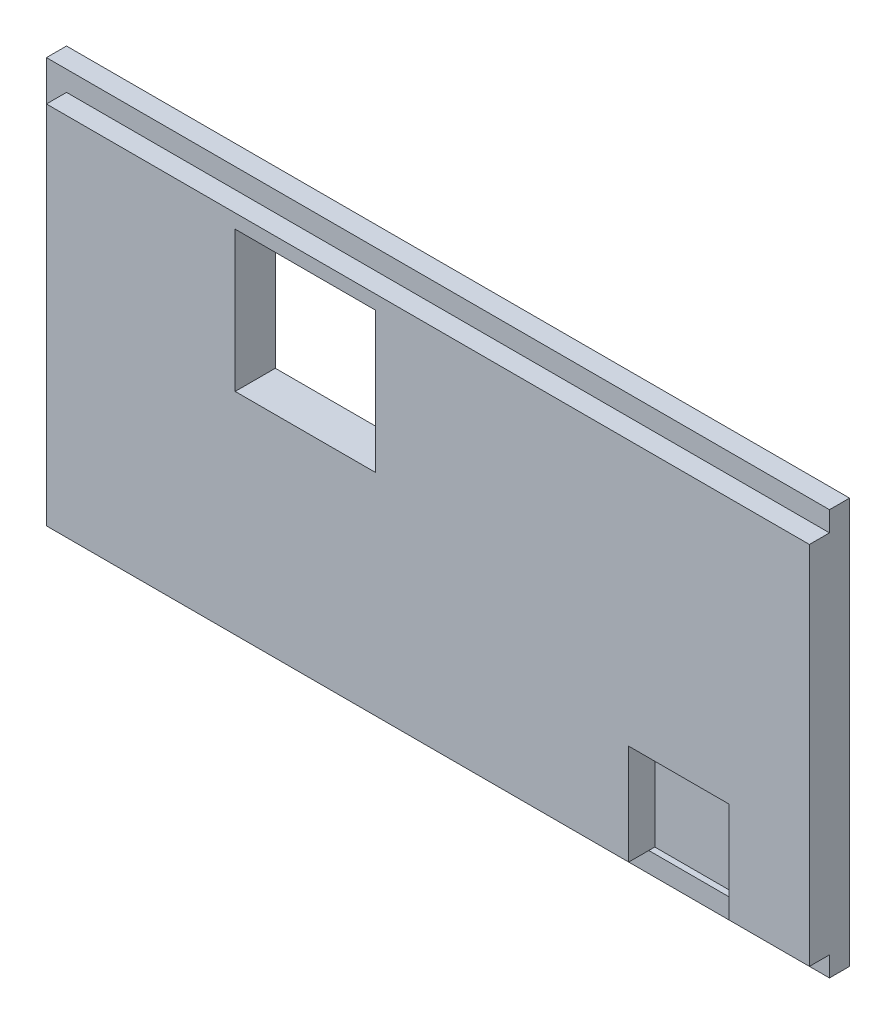
ISO-10303-21;
HEADER;
FILE_DESCRIPTION(('STEP AP214'),'2;1');
FILE_NAME('part.step','',(''),(''),'','','');
FILE_SCHEMA(('AUTOMOTIVE_DESIGN { 1 0 10303 214 1 1 1 1 }'));
ENDSEC;
DATA;
#1=APPLICATION_CONTEXT('core data for automotive mechanical design processes');
#2=APPLICATION_PROTOCOL_DEFINITION('international standard','automotive_design',2000,#1);
#3=PRODUCT_CONTEXT('',#1,'mechanical');
#4=PRODUCT('Part','Part','',(#3));
#5=PRODUCT_RELATED_PRODUCT_CATEGORY('part','',(#4));
#6=PRODUCT_DEFINITION_FORMATION('','',#4);
#7=PRODUCT_DEFINITION_CONTEXT('part definition',#1,'design');
#8=PRODUCT_DEFINITION('design','',#6,#7);
#9=PRODUCT_DEFINITION_SHAPE('','',#8);
#10=(LENGTH_UNIT() NAMED_UNIT(*) SI_UNIT(.MILLI.,.METRE.));
#11=(NAMED_UNIT(*) PLANE_ANGLE_UNIT() SI_UNIT($,.RADIAN.));
#12=(NAMED_UNIT(*) SI_UNIT($,.STERADIAN.) SOLID_ANGLE_UNIT());
#13=UNCERTAINTY_MEASURE_WITH_UNIT(LENGTH_MEASURE(1.E-05),#10,'distance_accuracy_value','');
#14=(GEOMETRIC_REPRESENTATION_CONTEXT(3) GLOBAL_UNCERTAINTY_ASSIGNED_CONTEXT((#13)) GLOBAL_UNIT_ASSIGNED_CONTEXT((#10,
#11,#12)) REPRESENTATION_CONTEXT('',''));
#15=CARTESIAN_POINT('',(0.,0.,0.));
#16=DIRECTION('',(0.,0.,1.));
#17=DIRECTION('',(1.,0.,0.));
#18=AXIS2_PLACEMENT_3D('',#15,#16,#17);
#19=CARTESIAN_POINT('',(-18.5,-9.1,2.));
#20=DIRECTION('',(0.,1.,0.));
#21=DIRECTION('',(-1.,0.,0.));
#22=AXIS2_PLACEMENT_3D('',#19,#20,#21);
#23=PLANE('',#22);
#24=DIRECTION('',(1.,0.,0.));
#25=VECTOR('',#24,1.);
#26=CARTESIAN_POINT('',(-18.5,-9.1,1.));
#27=LINE('',#26,#25);
#28=CARTESIAN_POINT('',(-18.5,-9.1,1.));
#29=VERTEX_POINT('',#28);
#30=CARTESIAN_POINT('',(10.5,-9.1,1.));
#31=VERTEX_POINT('',#30);
#32=EDGE_CURVE('E242',#29,#31,#27,.T.);
#33=ORIENTED_EDGE('',*,*,#32,.T.);
#34=DIRECTION('',(0.,0.,1.));
#35=VECTOR('',#34,1.);
#36=CARTESIAN_POINT('',(10.5,-9.1,0.7));
#37=LINE('',#36,#35);
#38=CARTESIAN_POINT('',(10.5,-9.1,2.));
#39=VERTEX_POINT('',#38);
#40=EDGE_CURVE('E161',#31,#39,#37,.T.);
#41=ORIENTED_EDGE('',*,*,#40,.T.);
#42=DIRECTION('',(1.,0.,0.));
#43=VECTOR('',#42,1.);
#44=CARTESIAN_POINT('',(-18.5,-9.1,2.));
#45=LINE('',#44,#43);
#46=CARTESIAN_POINT('',(-18.5,-9.1,2.));
#47=VERTEX_POINT('',#46);
#48=EDGE_CURVE('E231',#47,#39,#45,.T.);
#49=ORIENTED_EDGE('',*,*,#48,.F.);
#50=DIRECTION('',(0.,0.,-1.));
#51=VECTOR('',#50,1.);
#52=CARTESIAN_POINT('',(-18.5,-9.1,2.));
#53=LINE('',#52,#51);
#54=EDGE_CURVE('E255',#47,#29,#53,.T.);
#55=ORIENTED_EDGE('',*,*,#54,.T.);
#56=EDGE_LOOP('',(#33,#41,#49,#55));
#57=FACE_BOUND('',#56,.T.);
#58=ADVANCED_FACE('F33',(#57),#23,.F.);
#59=CARTESIAN_POINT('',(19.5,10.1,1.));
#60=DIRECTION('',(-1.,0.,0.));
#61=DIRECTION('',(0.,0.,1.));
#62=AXIS2_PLACEMENT_3D('',#59,#60,#61);
#63=PLANE('',#62);
#64=DIRECTION('',(0.,1.,0.));
#65=VECTOR('',#64,1.);
#66=CARTESIAN_POINT('',(19.5,10.1,0.));
#67=LINE('',#66,#65);
#68=CARTESIAN_POINT('',(19.5,-10.1,0.));
#69=VERTEX_POINT('',#68);
#70=CARTESIAN_POINT('',(19.5,10.1,0.));
#71=VERTEX_POINT('',#70);
#72=EDGE_CURVE('E258',#69,#71,#67,.T.);
#73=ORIENTED_EDGE('',*,*,#72,.T.);
#74=DIRECTION('',(0.,0.,-1.));
#75=VECTOR('',#74,1.);
#76=CARTESIAN_POINT('',(19.5,10.1,1.));
#77=LINE('',#76,#75);
#78=CARTESIAN_POINT('',(19.5,10.1,1.));
#79=VERTEX_POINT('',#78);
#80=EDGE_CURVE('E11',#79,#71,#77,.T.);
#81=ORIENTED_EDGE('',*,*,#80,.F.);
#82=DIRECTION('',(0.,1.,0.));
#83=VECTOR('',#82,1.);
#84=CARTESIAN_POINT('',(19.5,10.1,1.));
#85=LINE('',#84,#83);
#86=CARTESIAN_POINT('',(19.5,9.1,1.));
#87=VERTEX_POINT('',#86);
#88=EDGE_CURVE('E263',#87,#79,#85,.T.);
#89=ORIENTED_EDGE('',*,*,#88,.F.);
#90=DIRECTION('',(0.,0.,-1.));
#91=VECTOR('',#90,1.);
#92=CARTESIAN_POINT('',(19.5,9.1,2.));
#93=LINE('',#92,#91);
#94=CARTESIAN_POINT('',(19.5,9.1,2.));
#95=VERTEX_POINT('',#94);
#96=EDGE_CURVE('E249',#95,#87,#93,.T.);
#97=ORIENTED_EDGE('',*,*,#96,.F.);
#98=DIRECTION('',(0.,1.,0.));
#99=VECTOR('',#98,1.);
#100=CARTESIAN_POINT('',(19.5,9.1,2.));
#101=LINE('',#100,#99);
#102=CARTESIAN_POINT('',(19.5,-9.1,2.));
#103=VERTEX_POINT('',#102);
#104=EDGE_CURVE('E234',#103,#95,#101,.T.);
#105=ORIENTED_EDGE('',*,*,#104,.F.);
#106=DIRECTION('',(0.,0.,-1.));
#107=VECTOR('',#106,1.);
#108=CARTESIAN_POINT('',(19.5,-9.1,2.));
#109=LINE('',#108,#107);
#110=CARTESIAN_POINT('',(19.5,-9.1,1.));
#111=VERTEX_POINT('',#110);
#112=EDGE_CURVE('E252',#103,#111,#109,.T.);
#113=ORIENTED_EDGE('',*,*,#112,.T.);
#114=CARTESIAN_POINT('',(19.5,-10.1,1.));
#115=VERTEX_POINT('',#114);
#116=EDGE_CURVE('E259',#115,#111,#85,.T.);
#117=ORIENTED_EDGE('',*,*,#116,.F.);
#118=DIRECTION('',(0.,0.,-1.));
#119=VECTOR('',#118,1.);
#120=CARTESIAN_POINT('',(19.5,-10.1,1.));
#121=LINE('',#120,#119);
#122=EDGE_CURVE('E269',#115,#69,#121,.T.);
#123=ORIENTED_EDGE('',*,*,#122,.T.);
#124=EDGE_LOOP('',(#73,#81,#89,#97,#105,#113,#117,#123));
#125=FACE_BOUND('',#124,.T.);
#126=ADVANCED_FACE('F35',(#125),#63,.F.);
#127=CARTESIAN_POINT('',(-19.5,10.1,1.));
#128=DIRECTION('',(0.,-1.,0.));
#129=DIRECTION('',(0.,0.,-1.));
#130=AXIS2_PLACEMENT_3D('',#127,#128,#129);
#131=PLANE('',#130);
#132=DIRECTION('',(-1.,0.,0.));
#133=VECTOR('',#132,1.);
#134=CARTESIAN_POINT('',(-19.5,10.1,0.));
#135=LINE('',#134,#133);
#136=CARTESIAN_POINT('',(-19.5,10.1,0.));
#137=VERTEX_POINT('',#136);
#138=EDGE_CURVE('E272',#71,#137,#135,.T.);
#139=ORIENTED_EDGE('',*,*,#138,.T.);
#140=DIRECTION('',(0.,0.,-1.));
#141=VECTOR('',#140,1.);
#142=CARTESIAN_POINT('',(-19.5,10.1,1.));
#143=LINE('',#142,#141);
#144=CARTESIAN_POINT('',(-19.5,10.1,1.));
#145=VERTEX_POINT('',#144);
#146=EDGE_CURVE('E41',#145,#137,#143,.T.);
#147=ORIENTED_EDGE('',*,*,#146,.F.);
#148=DIRECTION('',(-1.,0.,0.));
#149=VECTOR('',#148,1.);
#150=CARTESIAN_POINT('',(-19.5,10.1,1.));
#151=LINE('',#150,#149);
#152=EDGE_CURVE('E262',#79,#145,#151,.T.);
#153=ORIENTED_EDGE('',*,*,#152,.F.);
#154=ORIENTED_EDGE('',*,*,#80,.T.);
#155=EDGE_LOOP('',(#139,#147,#153,#154));
#156=FACE_BOUND('',#155,.T.);
#157=ADVANCED_FACE('F308',(#156),#131,.F.);
#158=CARTESIAN_POINT('',(-19.5,10.1,1.));
#159=DIRECTION('',(1.,0.,0.));
#160=DIRECTION('',(0.,0.,-1.));
#161=AXIS2_PLACEMENT_3D('',#158,#159,#160);
#162=PLANE('',#161);
#163=DIRECTION('',(0.,-1.,0.));
#164=VECTOR('',#163,1.);
#165=CARTESIAN_POINT('',(-19.5,10.1,0.));
#166=LINE('',#165,#164);
#167=CARTESIAN_POINT('',(-19.5,-10.1,0.));
#168=VERTEX_POINT('',#167);
#169=EDGE_CURVE('E274',#137,#168,#166,.T.);
#170=ORIENTED_EDGE('',*,*,#169,.T.);
#171=DIRECTION('',(0.,0.,-1.));
#172=VECTOR('',#171,1.);
#173=CARTESIAN_POINT('',(-19.5,-10.1,1.));
#174=LINE('',#173,#172);
#175=CARTESIAN_POINT('',(-19.5,-10.1,1.));
#176=VERTEX_POINT('',#175);
#177=EDGE_CURVE('E280',#176,#168,#174,.T.);
#178=ORIENTED_EDGE('',*,*,#177,.F.);
#179=DIRECTION('',(0.,-1.,0.));
#180=VECTOR('',#179,1.);
#181=CARTESIAN_POINT('',(-19.5,10.1,1.));
#182=LINE('',#181,#180);
#183=EDGE_CURVE('E265',#145,#176,#182,.T.);
#184=ORIENTED_EDGE('',*,*,#183,.F.);
#185=ORIENTED_EDGE('',*,*,#146,.T.);
#186=EDGE_LOOP('',(#170,#178,#184,#185));
#187=FACE_BOUND('',#186,.T.);
#188=ADVANCED_FACE('F287',(#187),#162,.F.);
#189=CARTESIAN_POINT('',(-19.5,-10.1,1.));
#190=DIRECTION('',(0.,1.,0.));
#191=DIRECTION('',(0.,0.,1.));
#192=AXIS2_PLACEMENT_3D('',#189,#190,#191);
#193=PLANE('',#192);
#194=DIRECTION('',(1.,0.,0.));
#195=VECTOR('',#194,1.);
#196=CARTESIAN_POINT('',(-19.5,-10.1,0.));
#197=LINE('',#196,#195);
#198=EDGE_CURVE('E276',#168,#69,#197,.T.);
#199=ORIENTED_EDGE('',*,*,#198,.T.);
#200=ORIENTED_EDGE('',*,*,#122,.F.);
#201=DIRECTION('',(1.,0.,0.));
#202=VECTOR('',#201,1.);
#203=CARTESIAN_POINT('',(-19.5,-10.1,1.));
#204=LINE('',#203,#202);
#205=EDGE_CURVE('E267',#176,#115,#204,.T.);
#206=ORIENTED_EDGE('',*,*,#205,.F.);
#207=ORIENTED_EDGE('',*,*,#177,.T.);
#208=EDGE_LOOP('',(#199,#200,#206,#207));
#209=FACE_BOUND('',#208,.T.);
#210=ADVANCED_FACE('F297',(#209),#193,.F.);
#211=CARTESIAN_POINT('',(0.,0.,1.));
#212=DIRECTION('',(0.,0.,1.));
#213=DIRECTION('',(1.,0.,0.));
#214=AXIS2_PLACEMENT_3D('',#211,#212,#213);
#215=PLANE('',#214);
#216=DIRECTION('',(-1.,0.,0.));
#217=VECTOR('',#216,1.);
#218=CARTESIAN_POINT('',(-18.5,9.1,1.));
#219=LINE('',#218,#217);
#220=CARTESIAN_POINT('',(-18.5,9.1,1.));
#221=VERTEX_POINT('',#220);
#222=EDGE_CURVE('E230',#87,#221,#219,.T.);
#223=ORIENTED_EDGE('',*,*,#222,.F.);
#224=ORIENTED_EDGE('',*,*,#88,.T.);
#225=ORIENTED_EDGE('',*,*,#152,.T.);
#226=ORIENTED_EDGE('',*,*,#183,.T.);
#227=ORIENTED_EDGE('',*,*,#205,.T.);
#228=ORIENTED_EDGE('',*,*,#116,.T.);
#229=CARTESIAN_POINT('',(15.5,-9.1,1.));
#230=VERTEX_POINT('',#229);
#231=EDGE_CURVE('E241',#230,#111,#27,.T.);
#232=ORIENTED_EDGE('',*,*,#231,.F.);
#233=DIRECTION('',(1.,0.,0.));
#234=VECTOR('',#233,1.);
#235=CARTESIAN_POINT('',(0.,-9.1,1.));
#236=LINE('',#235,#234);
#237=EDGE_CURVE('E190',#31,#230,#236,.T.);
#238=ORIENTED_EDGE('',*,*,#237,.F.);
#239=ORIENTED_EDGE('',*,*,#32,.F.);
#240=DIRECTION('',(0.,-1.,0.));
#241=VECTOR('',#240,1.);
#242=CARTESIAN_POINT('',(-18.5,9.1,1.));
#243=LINE('',#242,#241);
#244=EDGE_CURVE('E225',#221,#29,#243,.T.);
#245=ORIENTED_EDGE('',*,*,#244,.F.);
#246=EDGE_LOOP('',(#223,#224,#225,#226,#227,#228,#232,#238,#239,#245));
#247=FACE_BOUND('',#246,.T.);
#248=ADVANCED_FACE('F306',(#247),#215,.T.);
#249=CARTESIAN_POINT('',(0.,0.,0.));
#250=DIRECTION('',(0.,0.,1.));
#251=DIRECTION('',(1.,0.,0.));
#252=AXIS2_PLACEMENT_3D('',#249,#250,#251);
#253=PLANE('',#252);
#254=DIRECTION('',(-1.,0.,0.));
#255=VECTOR('',#254,1.);
#256=CARTESIAN_POINT('',(0.,8.4,0.));
#257=LINE('',#256,#255);
#258=CARTESIAN_POINT('',(-2.09999999999999,8.4,0.));
#259=VERTEX_POINT('',#258);
#260=CARTESIAN_POINT('',(-9.09999999999999,8.4,0.));
#261=VERTEX_POINT('',#260);
#262=EDGE_CURVE('E219',#259,#261,#257,.T.);
#263=ORIENTED_EDGE('',*,*,#262,.T.);
#264=DIRECTION('',(0.,-1.,0.));
#265=VECTOR('',#264,1.);
#266=CARTESIAN_POINT('',(-9.09999999999999,0.,0.));
#267=LINE('',#266,#265);
#268=CARTESIAN_POINT('',(-9.09999999999999,1.4,0.));
#269=VERTEX_POINT('',#268);
#270=EDGE_CURVE('E222',#261,#269,#267,.T.);
#271=ORIENTED_EDGE('',*,*,#270,.T.);
#272=DIRECTION('',(1.,0.,0.));
#273=VECTOR('',#272,1.);
#274=CARTESIAN_POINT('',(0.,1.4,0.));
#275=LINE('',#274,#273);
#276=CARTESIAN_POINT('',(-2.09999999999999,1.4,0.));
#277=VERTEX_POINT('',#276);
#278=EDGE_CURVE('E208',#269,#277,#275,.T.);
#279=ORIENTED_EDGE('',*,*,#278,.T.);
#280=DIRECTION('',(0.,1.,0.));
#281=VECTOR('',#280,1.);
#282=CARTESIAN_POINT('',(-2.09999999999999,0.,0.));
#283=LINE('',#282,#281);
#284=EDGE_CURVE('E216',#277,#259,#283,.T.);
#285=ORIENTED_EDGE('',*,*,#284,.T.);
#286=EDGE_LOOP('',(#263,#271,#279,#285));
#287=FACE_BOUND('',#286,.T.);
#288=ORIENTED_EDGE('',*,*,#72,.F.);
#289=ORIENTED_EDGE('',*,*,#198,.F.);
#290=ORIENTED_EDGE('',*,*,#169,.F.);
#291=ORIENTED_EDGE('',*,*,#138,.F.);
#292=EDGE_LOOP('',(#288,#289,#290,#291));
#293=FACE_BOUND('',#292,.T.);
#294=ADVANCED_FACE('F294',(#287,#293),#253,.F.);
#295=CARTESIAN_POINT('',(-18.5,9.1,2.));
#296=DIRECTION('',(1.,0.,0.));
#297=DIRECTION('',(0.,1.,0.));
#298=AXIS2_PLACEMENT_3D('',#295,#296,#297);
#299=PLANE('',#298);
#300=ORIENTED_EDGE('',*,*,#244,.T.);
#301=ORIENTED_EDGE('',*,*,#54,.F.);
#302=DIRECTION('',(0.,-1.,0.));
#303=VECTOR('',#302,1.);
#304=CARTESIAN_POINT('',(-18.5,9.1,2.));
#305=LINE('',#304,#303);
#306=CARTESIAN_POINT('',(-18.5,9.1,2.));
#307=VERTEX_POINT('',#306);
#308=EDGE_CURVE('E226',#307,#47,#305,.T.);
#309=ORIENTED_EDGE('',*,*,#308,.F.);
#310=DIRECTION('',(0.,0.,-1.));
#311=VECTOR('',#310,1.);
#312=CARTESIAN_POINT('',(-18.5,9.1,2.));
#313=LINE('',#312,#311);
#314=EDGE_CURVE('E238',#307,#221,#313,.T.);
#315=ORIENTED_EDGE('',*,*,#314,.T.);
#316=EDGE_LOOP('',(#300,#301,#309,#315));
#317=FACE_BOUND('',#316,.T.);
#318=ADVANCED_FACE('F325',(#317),#299,.F.);
#319=CARTESIAN_POINT('',(15.5,-9.1,2.));
#320=VERTEX_POINT('',#319);
#321=EDGE_CURVE('E229',#320,#103,#45,.T.);
#322=ORIENTED_EDGE('',*,*,#321,.F.);
#323=DIRECTION('',(0.,0.,1.));
#324=VECTOR('',#323,1.);
#325=CARTESIAN_POINT('',(15.5,-9.1,0.7));
#326=LINE('',#325,#324);
#327=EDGE_CURVE('E48',#230,#320,#326,.T.);
#328=ORIENTED_EDGE('',*,*,#327,.F.);
#329=ORIENTED_EDGE('',*,*,#231,.T.);
#330=ORIENTED_EDGE('',*,*,#112,.F.);
#331=EDGE_LOOP('',(#322,#328,#329,#330));
#332=FACE_BOUND('',#331,.T.);
#333=ADVANCED_FACE('F323',(#332),#23,.F.);
#334=CARTESIAN_POINT('',(-18.5,9.1,2.));
#335=DIRECTION('',(0.,-1.,0.));
#336=DIRECTION('',(0.,0.,-1.));
#337=AXIS2_PLACEMENT_3D('',#334,#335,#336);
#338=PLANE('',#337);
#339=ORIENTED_EDGE('',*,*,#222,.T.);
#340=ORIENTED_EDGE('',*,*,#314,.F.);
#341=DIRECTION('',(-1.,0.,0.));
#342=VECTOR('',#341,1.);
#343=CARTESIAN_POINT('',(-18.5,9.1,2.));
#344=LINE('',#343,#342);
#345=EDGE_CURVE('E236',#95,#307,#344,.T.);
#346=ORIENTED_EDGE('',*,*,#345,.F.);
#347=ORIENTED_EDGE('',*,*,#96,.T.);
#348=EDGE_LOOP('',(#339,#340,#346,#347));
#349=FACE_BOUND('',#348,.T.);
#350=ADVANCED_FACE('F312',(#349),#338,.F.);
#351=CARTESIAN_POINT('',(0.,0.,2.));
#352=DIRECTION('',(0.,0.,1.));
#353=DIRECTION('',(1.,0.,0.));
#354=AXIS2_PLACEMENT_3D('',#351,#352,#353);
#355=PLANE('',#354);
#356=DIRECTION('',(0.,-1.,0.));
#357=VECTOR('',#356,1.);
#358=CARTESIAN_POINT('',(10.5,-9.1,2.));
#359=LINE('',#358,#357);
#360=CARTESIAN_POINT('',(10.5,-4.1,2.));
#361=VERTEX_POINT('',#360);
#362=EDGE_CURVE('E185',#361,#39,#359,.T.);
#363=ORIENTED_EDGE('',*,*,#362,.F.);
#364=DIRECTION('',(-1.,0.,0.));
#365=VECTOR('',#364,1.);
#366=CARTESIAN_POINT('',(10.5,-4.1,2.));
#367=LINE('',#366,#365);
#368=CARTESIAN_POINT('',(15.5,-4.1,2.));
#369=VERTEX_POINT('',#368);
#370=EDGE_CURVE('E177',#369,#361,#367,.T.);
#371=ORIENTED_EDGE('',*,*,#370,.F.);
#372=DIRECTION('',(0.,1.,0.));
#373=VECTOR('',#372,1.);
#374=CARTESIAN_POINT('',(15.5,-9.1,2.));
#375=LINE('',#374,#373);
#376=EDGE_CURVE('E180',#320,#369,#375,.T.);
#377=ORIENTED_EDGE('',*,*,#376,.F.);
#378=ORIENTED_EDGE('',*,*,#321,.T.);
#379=ORIENTED_EDGE('',*,*,#104,.T.);
#380=ORIENTED_EDGE('',*,*,#345,.T.);
#381=ORIENTED_EDGE('',*,*,#308,.T.);
#382=ORIENTED_EDGE('',*,*,#48,.T.);
#383=EDGE_LOOP('',(#363,#371,#377,#378,#379,#380,#381,#382));
#384=FACE_BOUND('',#383,.T.);
#385=DIRECTION('',(0.,-1.,0.));
#386=VECTOR('',#385,1.);
#387=CARTESIAN_POINT('',(-9.09999999999999,1.4,2.));
#388=LINE('',#387,#386);
#389=CARTESIAN_POINT('',(-9.09999999999999,8.4,2.));
#390=VERTEX_POINT('',#389);
#391=CARTESIAN_POINT('',(-9.09999999999999,1.4,2.));
#392=VERTEX_POINT('',#391);
#393=EDGE_CURVE('E195',#390,#392,#388,.T.);
#394=ORIENTED_EDGE('',*,*,#393,.F.);
#395=DIRECTION('',(-1.,0.,0.));
#396=VECTOR('',#395,1.);
#397=CARTESIAN_POINT('',(-9.09999999999999,8.4,2.));
#398=LINE('',#397,#396);
#399=CARTESIAN_POINT('',(-2.09999999999999,8.4,2.));
#400=VERTEX_POINT('',#399);
#401=EDGE_CURVE('E202',#400,#390,#398,.T.);
#402=ORIENTED_EDGE('',*,*,#401,.F.);
#403=DIRECTION('',(0.,1.,0.));
#404=VECTOR('',#403,1.);
#405=CARTESIAN_POINT('',(-2.09999999999999,1.4,2.));
#406=LINE('',#405,#404);
#407=CARTESIAN_POINT('',(-2.09999999999999,1.4,2.));
#408=VERTEX_POINT('',#407);
#409=EDGE_CURVE('E199',#408,#400,#406,.T.);
#410=ORIENTED_EDGE('',*,*,#409,.F.);
#411=DIRECTION('',(1.,0.,0.));
#412=VECTOR('',#411,1.);
#413=CARTESIAN_POINT('',(-9.09999999999999,1.4,2.));
#414=LINE('',#413,#412);
#415=EDGE_CURVE('E197',#392,#408,#414,.T.);
#416=ORIENTED_EDGE('',*,*,#415,.F.);
#417=EDGE_LOOP('',(#394,#402,#410,#416));
#418=FACE_BOUND('',#417,.T.);
#419=ADVANCED_FACE('F317',(#384,#418),#355,.T.);
#420=CARTESIAN_POINT('',(-9.09999999999999,1.4,-19.));
#421=DIRECTION('',(-1.,0.,0.));
#422=DIRECTION('',(0.,0.,1.));
#423=AXIS2_PLACEMENT_3D('',#420,#421,#422);
#424=PLANE('',#423);
#425=DIRECTION('',(0.,0.,1.));
#426=VECTOR('',#425,1.);
#427=CARTESIAN_POINT('',(-9.09999999999999,8.4,-19.));
#428=LINE('',#427,#426);
#429=EDGE_CURVE('E206',#261,#390,#428,.T.);
#430=ORIENTED_EDGE('',*,*,#429,.T.);
#431=ORIENTED_EDGE('',*,*,#393,.T.);
#432=DIRECTION('',(0.,0.,1.));
#433=VECTOR('',#432,1.);
#434=CARTESIAN_POINT('',(-9.09999999999999,1.4,-19.));
#435=LINE('',#434,#433);
#436=EDGE_CURVE('E205',#269,#392,#435,.T.);
#437=ORIENTED_EDGE('',*,*,#436,.F.);
#438=ORIENTED_EDGE('',*,*,#270,.F.);
#439=EDGE_LOOP('',(#430,#431,#437,#438));
#440=FACE_BOUND('',#439,.T.);
#441=ADVANCED_FACE('F359',(#440),#424,.F.);
#442=CARTESIAN_POINT('',(-9.09999999999999,8.4,-19.));
#443=DIRECTION('',(0.,1.,0.));
#444=DIRECTION('',(0.,0.,1.));
#445=AXIS2_PLACEMENT_3D('',#442,#443,#444);
#446=PLANE('',#445);
#447=DIRECTION('',(0.,0.,1.));
#448=VECTOR('',#447,1.);
#449=CARTESIAN_POINT('',(-2.09999999999999,8.4,-19.));
#450=LINE('',#449,#448);
#451=EDGE_CURVE('E209',#259,#400,#450,.T.);
#452=ORIENTED_EDGE('',*,*,#451,.T.);
#453=ORIENTED_EDGE('',*,*,#401,.T.);
#454=ORIENTED_EDGE('',*,*,#429,.F.);
#455=ORIENTED_EDGE('',*,*,#262,.F.);
#456=EDGE_LOOP('',(#452,#453,#454,#455));
#457=FACE_BOUND('',#456,.T.);
#458=ADVANCED_FACE('F355',(#457),#446,.F.);
#459=CARTESIAN_POINT('',(-2.09999999999999,1.4,-19.));
#460=DIRECTION('',(1.,0.,0.));
#461=DIRECTION('',(0.,0.,-1.));
#462=AXIS2_PLACEMENT_3D('',#459,#460,#461);
#463=PLANE('',#462);
#464=DIRECTION('',(0.,0.,1.));
#465=VECTOR('',#464,1.);
#466=CARTESIAN_POINT('',(-2.09999999999999,1.4,-19.));
#467=LINE('',#466,#465);
#468=EDGE_CURVE('E56',#277,#408,#467,.T.);
#469=ORIENTED_EDGE('',*,*,#468,.T.);
#470=ORIENTED_EDGE('',*,*,#409,.T.);
#471=ORIENTED_EDGE('',*,*,#451,.F.);
#472=ORIENTED_EDGE('',*,*,#284,.F.);
#473=EDGE_LOOP('',(#469,#470,#471,#472));
#474=FACE_BOUND('',#473,.T.);
#475=ADVANCED_FACE('F358',(#474),#463,.F.);
#476=CARTESIAN_POINT('',(-9.09999999999999,1.4,-19.));
#477=DIRECTION('',(0.,-1.,0.));
#478=DIRECTION('',(0.,0.,-1.));
#479=AXIS2_PLACEMENT_3D('',#476,#477,#478);
#480=PLANE('',#479);
#481=ORIENTED_EDGE('',*,*,#436,.T.);
#482=ORIENTED_EDGE('',*,*,#415,.T.);
#483=ORIENTED_EDGE('',*,*,#468,.F.);
#484=ORIENTED_EDGE('',*,*,#278,.F.);
#485=EDGE_LOOP('',(#481,#482,#483,#484));
#486=FACE_BOUND('',#485,.T.);
#487=ADVANCED_FACE('F349',(#486),#480,.F.);
#488=CARTESIAN_POINT('',(10.5,-9.1,0.7));
#489=DIRECTION('',(-1.,0.,0.));
#490=DIRECTION('',(0.,0.,1.));
#491=AXIS2_PLACEMENT_3D('',#488,#489,#490);
#492=PLANE('',#491);
#493=ORIENTED_EDGE('',*,*,#362,.T.);
#494=ORIENTED_EDGE('',*,*,#40,.F.);
#495=CARTESIAN_POINT('',(10.5,-9.1,0.7));
#496=VERTEX_POINT('',#495);
#497=EDGE_CURVE('E154',#496,#31,#37,.T.);
#498=ORIENTED_EDGE('',*,*,#497,.F.);
#499=DIRECTION('',(0.,-1.,0.));
#500=VECTOR('',#499,1.);
#501=CARTESIAN_POINT('',(10.5,-9.1,0.7));
#502=LINE('',#501,#500);
#503=CARTESIAN_POINT('',(10.5,-4.1,0.7));
#504=VERTEX_POINT('',#503);
#505=EDGE_CURVE('E158',#504,#496,#502,.T.);
#506=ORIENTED_EDGE('',*,*,#505,.F.);
#507=DIRECTION('',(0.,0.,1.));
#508=VECTOR('',#507,1.);
#509=CARTESIAN_POINT('',(10.5,-4.1,0.7));
#510=LINE('',#509,#508);
#511=EDGE_CURVE('E188',#504,#361,#510,.T.);
#512=ORIENTED_EDGE('',*,*,#511,.T.);
#513=EDGE_LOOP('',(#493,#494,#498,#506,#512));
#514=FACE_BOUND('',#513,.T.);
#515=ADVANCED_FACE('F156',(#514),#492,.F.);
#516=CARTESIAN_POINT('',(10.5,-4.1,0.7));
#517=DIRECTION('',(0.,1.,0.));
#518=DIRECTION('',(0.,0.,1.));
#519=AXIS2_PLACEMENT_3D('',#516,#517,#518);
#520=PLANE('',#519);
#521=ORIENTED_EDGE('',*,*,#370,.T.);
#522=ORIENTED_EDGE('',*,*,#511,.F.);
#523=DIRECTION('',(-1.,0.,0.));
#524=VECTOR('',#523,1.);
#525=CARTESIAN_POINT('',(10.5,-4.1,0.7));
#526=LINE('',#525,#524);
#527=CARTESIAN_POINT('',(15.5,-4.1,0.7));
#528=VERTEX_POINT('',#527);
#529=EDGE_CURVE('E176',#528,#504,#526,.T.);
#530=ORIENTED_EDGE('',*,*,#529,.F.);
#531=DIRECTION('',(0.,0.,1.));
#532=VECTOR('',#531,1.);
#533=CARTESIAN_POINT('',(15.5,-4.1,0.7));
#534=LINE('',#533,#532);
#535=EDGE_CURVE('E191',#528,#369,#534,.T.);
#536=ORIENTED_EDGE('',*,*,#535,.T.);
#537=EDGE_LOOP('',(#521,#522,#530,#536));
#538=FACE_BOUND('',#537,.T.);
#539=ADVANCED_FACE('F341',(#538),#520,.F.);
#540=CARTESIAN_POINT('',(15.5,-9.1,0.7));
#541=DIRECTION('',(1.,0.,0.));
#542=DIRECTION('',(0.,0.,-1.));
#543=AXIS2_PLACEMENT_3D('',#540,#541,#542);
#544=PLANE('',#543);
#545=ORIENTED_EDGE('',*,*,#376,.T.);
#546=ORIENTED_EDGE('',*,*,#535,.F.);
#547=DIRECTION('',(0.,1.,0.));
#548=VECTOR('',#547,1.);
#549=CARTESIAN_POINT('',(15.5,-9.1,0.7));
#550=LINE('',#549,#548);
#551=CARTESIAN_POINT('',(15.5,-9.1,0.7));
#552=VERTEX_POINT('',#551);
#553=EDGE_CURVE('E172',#552,#528,#550,.T.);
#554=ORIENTED_EDGE('',*,*,#553,.F.);
#555=EDGE_CURVE('E168',#552,#230,#326,.T.);
#556=ORIENTED_EDGE('',*,*,#555,.T.);
#557=ORIENTED_EDGE('',*,*,#327,.T.);
#558=EDGE_LOOP('',(#545,#546,#554,#556,#557));
#559=FACE_BOUND('',#558,.T.);
#560=ADVANCED_FACE('F339',(#559),#544,.F.);
#561=CARTESIAN_POINT('',(10.5,-9.1,0.7));
#562=DIRECTION('',(0.,-1.,0.));
#563=DIRECTION('',(0.,0.,-1.));
#564=AXIS2_PLACEMENT_3D('',#561,#562,#563);
#565=PLANE('',#564);
#566=ORIENTED_EDGE('',*,*,#237,.T.);
#567=ORIENTED_EDGE('',*,*,#555,.F.);
#568=DIRECTION('',(1.,0.,0.));
#569=VECTOR('',#568,1.);
#570=CARTESIAN_POINT('',(10.5,-9.1,0.7));
#571=LINE('',#570,#569);
#572=EDGE_CURVE('E166',#496,#552,#571,.T.);
#573=ORIENTED_EDGE('',*,*,#572,.F.);
#574=ORIENTED_EDGE('',*,*,#497,.T.);
#575=EDGE_LOOP('',(#566,#567,#573,#574));
#576=FACE_BOUND('',#575,.T.);
#577=ADVANCED_FACE('F167',(#576),#565,.F.);
#578=CARTESIAN_POINT('',(0.,0.,0.7));
#579=DIRECTION('',(0.,0.,-1.));
#580=DIRECTION('',(-1.,0.,0.));
#581=AXIS2_PLACEMENT_3D('',#578,#579,#580);
#582=PLANE('',#581);
#583=ORIENTED_EDGE('',*,*,#505,.T.);
#584=ORIENTED_EDGE('',*,*,#572,.T.);
#585=ORIENTED_EDGE('',*,*,#553,.T.);
#586=ORIENTED_EDGE('',*,*,#529,.T.);
#587=EDGE_LOOP('',(#583,#584,#585,#586));
#588=FACE_BOUND('',#587,.T.);
#589=ADVANCED_FACE('F174',(#588),#582,.F.);
#590=CLOSED_SHELL('',(#58,#126,#157,#188,#210,#248,#294,#318,#333,#350,#419,#441,#458,#475,#487,
#515,#539,#560,#577,#589));
#591=MANIFOLD_SOLID_BREP('B2',#590);
#592=ADVANCED_BREP_SHAPE_REPRESENTATION('',(#18,#591),#14);
#593=SHAPE_DEFINITION_REPRESENTATION(#9,#592);
ENDSEC;
END-ISO-10303-21;
